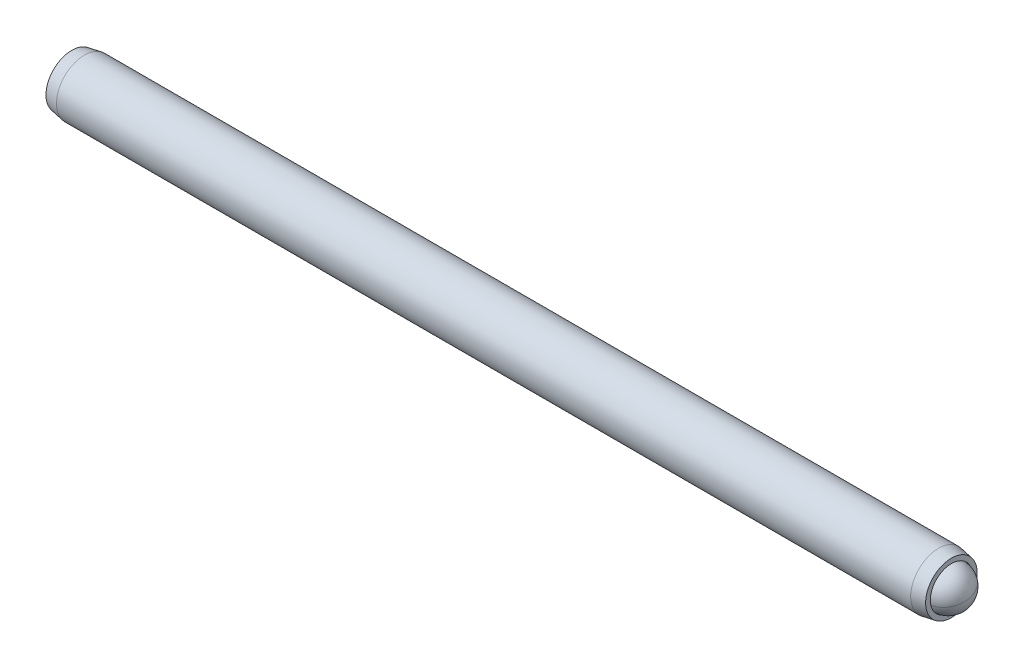
ISO-10303-21;
HEADER;
FILE_DESCRIPTION(('STEP AP214'),'2;1');
FILE_NAME('part.step','',(''),(''),'','','');
FILE_SCHEMA(('AUTOMOTIVE_DESIGN { 1 0 10303 214 1 1 1 1 }'));
ENDSEC;
DATA;
#1=APPLICATION_CONTEXT('core data for automotive mechanical design processes');
#2=APPLICATION_PROTOCOL_DEFINITION('international standard','automotive_design',2000,#1);
#3=PRODUCT_CONTEXT('',#1,'mechanical');
#4=PRODUCT('Part','Part','',(#3));
#5=PRODUCT_RELATED_PRODUCT_CATEGORY('part','',(#4));
#6=PRODUCT_DEFINITION_FORMATION('','',#4);
#7=PRODUCT_DEFINITION_CONTEXT('part definition',#1,'design');
#8=PRODUCT_DEFINITION('design','',#6,#7);
#9=PRODUCT_DEFINITION_SHAPE('','',#8);
#10=(LENGTH_UNIT() NAMED_UNIT(*) SI_UNIT(.MILLI.,.METRE.));
#11=(NAMED_UNIT(*) PLANE_ANGLE_UNIT() SI_UNIT($,.RADIAN.));
#12=(NAMED_UNIT(*) SI_UNIT($,.STERADIAN.) SOLID_ANGLE_UNIT());
#13=UNCERTAINTY_MEASURE_WITH_UNIT(LENGTH_MEASURE(1.E-05),#10,'distance_accuracy_value','');
#14=(GEOMETRIC_REPRESENTATION_CONTEXT(3) GLOBAL_UNCERTAINTY_ASSIGNED_CONTEXT((#13)) GLOBAL_UNIT_ASSIGNED_CONTEXT((#10,
#11,#12)) REPRESENTATION_CONTEXT('',''));
#15=CARTESIAN_POINT('',(0.,0.,0.));
#16=DIRECTION('',(0.,0.,1.));
#17=DIRECTION('',(1.,0.,0.));
#18=AXIS2_PLACEMENT_3D('',#15,#16,#17);
#19=CARTESIAN_POINT('',(-52.5013459470191,2.74204998828508,-0.965131231055238));
#20=DIRECTION('',(-1.,0.,0.));
#21=DIRECTION('',(0.,-1.,0.));
#22=AXIS2_PLACEMENT_3D('',#19,#20,#21);
#23=PLANE('',#22);
#24=DIRECTION('',(0.,0.866025403784439,-0.5));
#25=VECTOR('',#24,1.);
#26=CARTESIAN_POINT('',(-52.5013459470191,2.61504998828507,-2.33078112403967));
#27=LINE('',#26,#25);
#28=CARTESIAN_POINT('',(-52.5013459470191,1.49586248828506,-1.684617919641));
#29=VERTEX_POINT('',#28);
#30=CARTESIAN_POINT('',(-52.5013459470191,2.74204998828508,-2.40410460822675));
#31=VERTEX_POINT('',#30);
#32=EDGE_CURVE('P0_E164',#29,#31,#27,.T.);
#33=ORIENTED_EDGE('',*,*,#32,.T.);
#34=DIRECTION('',(0.,0.866025403784439,0.5));
#35=VECTOR('',#34,1.);
#36=CARTESIAN_POINT('',(-52.5013459470191,3.86123748828509,-1.75794140382808));
#37=LINE('',#36,#35);
#38=CARTESIAN_POINT('',(-52.5013459470191,3.9882374882851,-1.684617919641));
#39=VERTEX_POINT('',#38);
#40=EDGE_CURVE('P0_E166',#31,#39,#37,.T.);
#41=ORIENTED_EDGE('',*,*,#40,.T.);
#42=DIRECTION('',(0.,0.,1.));
#43=VECTOR('',#42,1.);
#44=CARTESIAN_POINT('',(-52.5013459470191,3.9882374882851,-0.392291510843656));
#45=LINE('',#44,#43);
#46=CARTESIAN_POINT('',(-52.5013459470191,3.9882374882851,-0.245644542469482));
#47=VERTEX_POINT('',#46);
#48=EDGE_CURVE('P0_E156',#39,#47,#45,.T.);
#49=ORIENTED_EDGE('',*,*,#48,.T.);
#50=DIRECTION('',(0.,-0.866025403784438,0.500000000000001));
#51=VECTOR('',#50,1.);
#52=CARTESIAN_POINT('',(-52.5013459470191,2.86904998828509,0.400518661929189));
#53=LINE('',#52,#51);
#54=CARTESIAN_POINT('',(-52.5013459470191,2.74204998828508,0.473842146116277));
#55=VERTEX_POINT('',#54);
#56=EDGE_CURVE('P0_E158',#47,#55,#53,.T.);
#57=ORIENTED_EDGE('',*,*,#56,.T.);
#58=DIRECTION('',(0.,-0.866025403784439,-0.5));
#59=VECTOR('',#58,1.);
#60=CARTESIAN_POINT('',(-52.5013459470191,1.62286248828507,-0.172321058282393));
#61=LINE('',#60,#59);
#62=CARTESIAN_POINT('',(-52.5013459470191,1.49586248828506,-0.245644542469481));
#63=VERTEX_POINT('',#62);
#64=EDGE_CURVE('P0_E160',#55,#63,#61,.T.);
#65=ORIENTED_EDGE('',*,*,#64,.T.);
#66=DIRECTION('',(0.,0.,-1.));
#67=VECTOR('',#66,1.);
#68=CARTESIAN_POINT('',(-52.5013459470191,1.49586248828506,-1.53797095126682));
#69=LINE('',#68,#67);
#70=EDGE_CURVE('P0_E162',#63,#29,#69,.T.);
#71=ORIENTED_EDGE('',*,*,#70,.T.);
#72=EDGE_LOOP('',(#33,#41,#49,#57,#65,#71));
#73=FACE_BOUND('',#72,.T.);
#74=CARTESIAN_POINT('',(-52.5013459470191,2.74204998828508,-0.965131231055238));
#75=DIRECTION('',(1.,0.,0.));
#76=DIRECTION('',(0.,1.,0.));
#77=AXIS2_PLACEMENT_3D('',#74,#75,#76);
#78=CIRCLE('',#77,2.921);
#79=CARTESIAN_POINT('',(-52.5013459470191,5.66304998828508,-0.965131231055238));
#80=VERTEX_POINT('',#79);
#81=EDGE_CURVE('P0_E150',#80,#80,#78,.T.);
#82=ORIENTED_EDGE('',*,*,#81,.F.);
#83=EDGE_LOOP('',(#82));
#84=FACE_BOUND('',#83,.T.);
#85=ADVANCED_FACE('P0_F17',(#73,#84),#23,.T.);
#86=CARTESIAN_POINT('',(-51.0608403648362,2.74204998828508,-0.965131231055238));
#87=DIRECTION('',(1.,0.,0.));
#88=DIRECTION('',(0.,1.,0.));
#89=AXIS2_PLACEMENT_3D('',#86,#87,#88);
#90=CONICAL_SURFACE('',#89,3.175,0.174532925199433);
#91=ORIENTED_EDGE('',*,*,#81,.T.);
#92=EDGE_LOOP('',(#91));
#93=FACE_BOUND('',#92,.T.);
#94=CARTESIAN_POINT('',(-51.0608403648362,2.74204998828508,-0.965131231055238));
#95=DIRECTION('',(1.,0.,0.));
#96=DIRECTION('',(0.,1.,0.));
#97=AXIS2_PLACEMENT_3D('',#94,#95,#96);
#98=CIRCLE('',#97,3.175);
#99=CARTESIAN_POINT('',(-51.0608403648362,5.91704998828508,-0.965131231055238));
#100=VERTEX_POINT('',#99);
#101=EDGE_CURVE('P0_E147',#100,#100,#98,.T.);
#102=ORIENTED_EDGE('',*,*,#101,.F.);
#103=EDGE_LOOP('',(#102));
#104=FACE_BOUND('',#103,.T.);
#105=ADVANCED_FACE('P0_F225',(#93,#104),#90,.T.);
#106=CARTESIAN_POINT('',(43.34980800758,2.7420499882851,-0.965131231055238));
#107=DIRECTION('',(1.,0.,0.));
#108=DIRECTION('',(0.,1.,0.));
#109=AXIS2_PLACEMENT_3D('',#106,#107,#108);
#110=CYLINDRICAL_SURFACE('',#109,3.17499999999999);
#111=ORIENTED_EDGE('',*,*,#101,.T.);
#112=EDGE_LOOP('',(#111));
#113=FACE_BOUND('',#112,.T.);
#114=CARTESIAN_POINT('',(45.626148470798,2.7420499882851,-0.965131231055238));
#115=DIRECTION('',(1.,0.,0.));
#116=DIRECTION('',(0.,1.,0.));
#117=AXIS2_PLACEMENT_3D('',#114,#115,#116);
#118=CIRCLE('',#117,3.17499999999999);
#119=CARTESIAN_POINT('',(45.626148470798,5.91704998828508,-0.965131231055238));
#120=VERTEX_POINT('',#119);
#121=EDGE_CURVE('P0_E144',#120,#120,#118,.T.);
#122=ORIENTED_EDGE('',*,*,#121,.F.);
#123=EDGE_LOOP('',(#122));
#124=FACE_BOUND('',#123,.T.);
#125=ADVANCED_FACE('P0_F231',(#113,#124),#110,.T.);
#126=CARTESIAN_POINT('',(47.0666540529809,2.7420499882851,-0.965131231055238));
#127=DIRECTION('',(-1.,0.,0.));
#128=DIRECTION('',(0.,-1.,0.));
#129=AXIS2_PLACEMENT_3D('',#126,#127,#128);
#130=CONICAL_SURFACE('',#129,2.92099999999999,0.174532925199434);
#131=ORIENTED_EDGE('',*,*,#121,.T.);
#132=EDGE_LOOP('',(#131));
#133=FACE_BOUND('',#132,.T.);
#134=CARTESIAN_POINT('',(47.0666540529809,2.7420499882851,-0.965131231055238));
#135=DIRECTION('',(1.,0.,0.));
#136=DIRECTION('',(0.,1.,0.));
#137=AXIS2_PLACEMENT_3D('',#134,#135,#136);
#138=CIRCLE('',#137,2.92099999999999);
#139=CARTESIAN_POINT('',(47.0666540529809,5.66304998828508,-0.965131231055238));
#140=VERTEX_POINT('',#139);
#141=EDGE_CURVE('P0_E141',#140,#140,#138,.T.);
#142=ORIENTED_EDGE('',*,*,#141,.F.);
#143=EDGE_LOOP('',(#142));
#144=FACE_BOUND('',#143,.T.);
#145=ADVANCED_FACE('P0_F275',(#133,#144),#130,.T.);
#146=CARTESIAN_POINT('',(47.0666540529809,5.66304998828508,-0.965131231055238));
#147=DIRECTION('',(1.,0.,0.));
#148=DIRECTION('',(0.,1.,0.));
#149=AXIS2_PLACEMENT_3D('',#146,#147,#148);
#150=PLANE('',#149);
#151=ORIENTED_EDGE('',*,*,#141,.T.);
#152=EDGE_LOOP('',(#151));
#153=FACE_BOUND('',#152,.T.);
#154=CARTESIAN_POINT('',(47.0666540529809,2.7420499882851,-0.965131231055238));
#155=DIRECTION('',(1.,0.,0.));
#156=DIRECTION('',(0.,1.,0.));
#157=AXIS2_PLACEMENT_3D('',#154,#155,#156);
#158=CIRCLE('',#157,2.38760000000001);
#159=CARTESIAN_POINT('',(47.0666540529809,5.1296499882851,-0.965131231055238));
#160=VERTEX_POINT('',#159);
#161=EDGE_CURVE('P0_E138',#160,#160,#158,.T.);
#162=ORIENTED_EDGE('',*,*,#161,.F.);
#163=EDGE_LOOP('',(#162));
#164=FACE_BOUND('',#163,.T.);
#165=ADVANCED_FACE('P0_F271',(#153,#164),#150,.T.);
#166=CARTESIAN_POINT('',(43.34980800758,2.7420499882851,-0.965131231055238));
#167=DIRECTION('',(1.,0.,0.));
#168=DIRECTION('',(0.,1.,0.));
#169=AXIS2_PLACEMENT_3D('',#166,#167,#168);
#170=CYLINDRICAL_SURFACE('',#169,2.38760000000001);
#171=ORIENTED_EDGE('',*,*,#161,.T.);
#172=EDGE_LOOP('',(#171));
#173=FACE_BOUND('',#172,.T.);
#174=CARTESIAN_POINT('',(45.73740800758,2.7420499882851,-0.965131231055238));
#175=DIRECTION('',(1.,0.,0.));
#176=DIRECTION('',(0.,1.,0.));
#177=AXIS2_PLACEMENT_3D('',#174,#175,#176);
#178=CIRCLE('',#177,2.38760000000001);
#179=CARTESIAN_POINT('',(45.73740800758,5.1296499882851,-0.965131231055238));
#180=VERTEX_POINT('',#179);
#181=EDGE_CURVE('P0_E126',#180,#180,#178,.T.);
#182=ORIENTED_EDGE('',*,*,#181,.F.);
#183=EDGE_LOOP('',(#182));
#184=FACE_BOUND('',#183,.T.);
#185=ADVANCED_FACE('P0_F267',(#173,#184),#170,.F.);
#186=CARTESIAN_POINT('',(43.34980800758,2.7420499882851,-0.965131231055238));
#187=DIRECTION('',(1.,0.,0.));
#188=DIRECTION('',(0.,1.,0.));
#189=AXIS2_PLACEMENT_3D('',#186,#187,#188);
#190=CONICAL_SURFACE('',#189,0.,0.78539816339745);
#191=ORIENTED_EDGE('',*,*,#181,.T.);
#192=EDGE_LOOP('',(#191));
#193=FACE_BOUND('',#192,.T.);
#194=CARTESIAN_POINT('',(43.34980800758,2.7420499882851,-0.965131231055238));
#195=VERTEX_POINT('',#194);
#196=VERTEX_LOOP('',#195);
#197=FACE_BOUND('',#196,.T.);
#198=ADVANCED_FACE('P0_F221',(#193,#197),#190,.F.);
#199=CARTESIAN_POINT('',(-49.4533459470191,2.74204998828508,0.180548209367926));
#200=DIRECTION('',(0.,0.5,0.866025403784438));
#201=DIRECTION('',(0.,-0.866025403784438,0.500000000000001));
#202=AXIS2_PLACEMENT_3D('',#199,#200,#201);
#203=PLANE('',#202);
#204=DIRECTION('',(-1.,0.,0.));
#205=VECTOR('',#204,1.);
#206=CARTESIAN_POINT('',(-49.4533459470191,2.74204998828508,0.180548209367926));
#207=LINE('',#206,#205);
#208=CARTESIAN_POINT('',(-49.4533459470191,2.74204998828508,0.180548209367926));
#209=VERTEX_POINT('',#208);
#210=CARTESIAN_POINT('',(-52.2473459470191,2.74204998828508,0.180548209367926));
#211=VERTEX_POINT('',#210);
#212=EDGE_CURVE('P0_E124',#209,#211,#207,.T.);
#213=ORIENTED_EDGE('',*,*,#212,.T.);
#214=DIRECTION('',(0.,0.866025403784438,-0.500000000000001));
#215=VECTOR('',#214,1.);
#216=CARTESIAN_POINT('',(-52.2473459470191,3.73423748828508,-0.392291510843656));
#217=LINE('',#216,#215);
#218=CARTESIAN_POINT('',(-52.2473459470191,3.73423748828508,-0.392291510843656));
#219=VERTEX_POINT('',#218);
#220=EDGE_CURVE('P0_E26',#211,#219,#217,.T.);
#221=ORIENTED_EDGE('',*,*,#220,.T.);
#222=DIRECTION('',(-1.,0.,0.));
#223=VECTOR('',#222,1.);
#224=CARTESIAN_POINT('',(-49.4533459470191,3.73423748828508,-0.392291510843656));
#225=LINE('',#224,#223);
#226=CARTESIAN_POINT('',(-49.4533459470191,3.73423748828508,-0.392291510843656));
#227=VERTEX_POINT('',#226);
#228=EDGE_CURVE('P0_E90',#227,#219,#225,.T.);
#229=ORIENTED_EDGE('',*,*,#228,.F.);
#230=DIRECTION('',(0.,0.866025403784438,-0.5));
#231=VECTOR('',#230,1.);
#232=CARTESIAN_POINT('',(-49.4533459470191,2.74204998828508,0.180548209367926));
#233=LINE('',#232,#231);
#234=EDGE_CURVE('P0_E94',#209,#227,#233,.T.);
#235=ORIENTED_EDGE('',*,*,#234,.F.);
#236=EDGE_LOOP('',(#213,#221,#229,#235));
#237=FACE_BOUND('',#236,.T.);
#238=ADVANCED_FACE('P0_F92',(#237),#203,.F.);
#239=CARTESIAN_POINT('',(-49.4533459470191,1.74986248828508,-0.392291510843656));
#240=DIRECTION('',(0.,-0.499999999999999,0.866025403784439));
#241=DIRECTION('',(0.,-0.866025403784439,-0.5));
#242=AXIS2_PLACEMENT_3D('',#239,#240,#241);
#243=PLANE('',#242);
#244=DIRECTION('',(-1.,0.,0.));
#245=VECTOR('',#244,1.);
#246=CARTESIAN_POINT('',(-49.4533459470191,1.74986248828508,-0.392291510843656));
#247=LINE('',#246,#245);
#248=CARTESIAN_POINT('',(-49.4533459470191,1.74986248828508,-0.392291510843656));
#249=VERTEX_POINT('',#248);
#250=CARTESIAN_POINT('',(-52.2473459470191,1.74986248828508,-0.392291510843656));
#251=VERTEX_POINT('',#250);
#252=EDGE_CURVE('P0_E127',#249,#251,#247,.T.);
#253=ORIENTED_EDGE('',*,*,#252,.T.);
#254=DIRECTION('',(0.,0.866025403784439,0.5));
#255=VECTOR('',#254,1.);
#256=CARTESIAN_POINT('',(-52.2473459470191,2.74204998828508,0.180548209367926));
#257=LINE('',#256,#255);
#258=EDGE_CURVE('P0_E41',#251,#211,#257,.T.);
#259=ORIENTED_EDGE('',*,*,#258,.T.);
#260=ORIENTED_EDGE('',*,*,#212,.F.);
#261=DIRECTION('',(0.,0.866025403784439,0.499999999999999));
#262=VECTOR('',#261,1.);
#263=CARTESIAN_POINT('',(-49.4533459470191,1.74986248828508,-0.392291510843656));
#264=LINE('',#263,#262);
#265=EDGE_CURVE('P0_E99',#249,#209,#264,.T.);
#266=ORIENTED_EDGE('',*,*,#265,.F.);
#267=EDGE_LOOP('',(#253,#259,#260,#266));
#268=FACE_BOUND('',#267,.T.);
#269=ADVANCED_FACE('P0_F212',(#268),#243,.F.);
#270=CARTESIAN_POINT('',(-49.4533459470191,1.74986248828508,-1.53797095126682));
#271=DIRECTION('',(0.,-1.,0.));
#272=DIRECTION('',(0.,0.,-1.));
#273=AXIS2_PLACEMENT_3D('',#270,#271,#272);
#274=PLANE('',#273);
#275=DIRECTION('',(-1.,0.,0.));
#276=VECTOR('',#275,1.);
#277=CARTESIAN_POINT('',(-49.4533459470191,1.74986248828508,-1.53797095126682));
#278=LINE('',#277,#276);
#279=CARTESIAN_POINT('',(-49.4533459470191,1.74986248828508,-1.53797095126682));
#280=VERTEX_POINT('',#279);
#281=CARTESIAN_POINT('',(-52.2473459470191,1.74986248828508,-1.53797095126682));
#282=VERTEX_POINT('',#281);
#283=EDGE_CURVE('P0_E129',#280,#282,#278,.T.);
#284=ORIENTED_EDGE('',*,*,#283,.T.);
#285=DIRECTION('',(0.,0.,1.));
#286=VECTOR('',#285,1.);
#287=CARTESIAN_POINT('',(-52.2473459470191,1.74986248828508,-0.392291510843656));
#288=LINE('',#287,#286);
#289=EDGE_CURVE('P0_E171',#282,#251,#288,.T.);
#290=ORIENTED_EDGE('',*,*,#289,.T.);
#291=ORIENTED_EDGE('',*,*,#252,.F.);
#292=DIRECTION('',(0.,0.,1.));
#293=VECTOR('',#292,1.);
#294=CARTESIAN_POINT('',(-49.4533459470191,1.74986248828508,-1.53797095126682));
#295=LINE('',#294,#293);
#296=EDGE_CURVE('P0_E121',#280,#249,#295,.T.);
#297=ORIENTED_EDGE('',*,*,#296,.F.);
#298=EDGE_LOOP('',(#284,#290,#291,#297));
#299=FACE_BOUND('',#298,.T.);
#300=ADVANCED_FACE('P0_F211',(#299),#274,.F.);
#301=CARTESIAN_POINT('',(-49.4533459470191,2.74204998828508,-2.1108106714784));
#302=DIRECTION('',(0.,-0.5,-0.866025403784439));
#303=DIRECTION('',(0.,0.866025403784439,-0.5));
#304=AXIS2_PLACEMENT_3D('',#301,#302,#303);
#305=PLANE('',#304);
#306=DIRECTION('',(-1.,0.,0.));
#307=VECTOR('',#306,1.);
#308=CARTESIAN_POINT('',(-49.4533459470191,2.74204998828508,-2.1108106714784));
#309=LINE('',#308,#307);
#310=CARTESIAN_POINT('',(-49.4533459470191,2.74204998828508,-2.1108106714784));
#311=VERTEX_POINT('',#310);
#312=CARTESIAN_POINT('',(-52.2473459470191,2.74204998828508,-2.1108106714784));
#313=VERTEX_POINT('',#312);
#314=EDGE_CURVE('P0_E132',#311,#313,#309,.T.);
#315=ORIENTED_EDGE('',*,*,#314,.T.);
#316=DIRECTION('',(0.,-0.866025403784439,0.5));
#317=VECTOR('',#316,1.);
#318=CARTESIAN_POINT('',(-52.2473459470191,1.74986248828508,-1.53797095126682));
#319=LINE('',#318,#317);
#320=EDGE_CURVE('P0_E169',#313,#282,#319,.T.);
#321=ORIENTED_EDGE('',*,*,#320,.T.);
#322=ORIENTED_EDGE('',*,*,#283,.F.);
#323=DIRECTION('',(0.,-0.866025403784439,0.5));
#324=VECTOR('',#323,1.);
#325=CARTESIAN_POINT('',(-49.4533459470191,2.74204998828508,-2.1108106714784));
#326=LINE('',#325,#324);
#327=EDGE_CURVE('P0_E118',#311,#280,#326,.T.);
#328=ORIENTED_EDGE('',*,*,#327,.F.);
#329=EDGE_LOOP('',(#315,#321,#322,#328));
#330=FACE_BOUND('',#329,.T.);
#331=ADVANCED_FACE('P0_F208',(#330),#305,.F.);
#332=CARTESIAN_POINT('',(-49.4533459470191,3.73423748828508,-1.53797095126682));
#333=DIRECTION('',(0.,0.5,-0.866025403784439));
#334=DIRECTION('',(0.,0.866025403784439,0.5));
#335=AXIS2_PLACEMENT_3D('',#332,#333,#334);
#336=PLANE('',#335);
#337=DIRECTION('',(-1.,0.,0.));
#338=VECTOR('',#337,1.);
#339=CARTESIAN_POINT('',(-49.4533459470191,3.73423748828508,-1.53797095126682));
#340=LINE('',#339,#338);
#341=CARTESIAN_POINT('',(-49.4533459470191,3.73423748828508,-1.53797095126682));
#342=VERTEX_POINT('',#341);
#343=CARTESIAN_POINT('',(-52.2473459470191,3.73423748828508,-1.53797095126682));
#344=VERTEX_POINT('',#343);
#345=EDGE_CURVE('P0_E98',#342,#344,#340,.T.);
#346=ORIENTED_EDGE('',*,*,#345,.T.);
#347=DIRECTION('',(0.,-0.866025403784439,-0.5));
#348=VECTOR('',#347,1.);
#349=CARTESIAN_POINT('',(-52.2473459470191,2.74204998828508,-2.1108106714784));
#350=LINE('',#349,#348);
#351=EDGE_CURVE('P0_E153',#344,#313,#350,.T.);
#352=ORIENTED_EDGE('',*,*,#351,.T.);
#353=ORIENTED_EDGE('',*,*,#314,.F.);
#354=DIRECTION('',(0.,-0.866025403784439,-0.5));
#355=VECTOR('',#354,1.);
#356=CARTESIAN_POINT('',(-49.4533459470191,3.73423748828508,-1.53797095126682));
#357=LINE('',#356,#355);
#358=EDGE_CURVE('P0_E108',#342,#311,#357,.T.);
#359=ORIENTED_EDGE('',*,*,#358,.F.);
#360=EDGE_LOOP('',(#346,#352,#353,#359));
#361=FACE_BOUND('',#360,.T.);
#362=ADVANCED_FACE('P0_F204',(#361),#336,.F.);
#363=CARTESIAN_POINT('',(-49.4533459470191,3.73423748828508,-0.392291510843656));
#364=DIRECTION('',(0.,1.,0.));
#365=DIRECTION('',(-1.,0.,0.));
#366=AXIS2_PLACEMENT_3D('',#363,#364,#365);
#367=PLANE('',#366);
#368=ORIENTED_EDGE('',*,*,#228,.T.);
#369=DIRECTION('',(0.,0.,-1.));
#370=VECTOR('',#369,1.);
#371=CARTESIAN_POINT('',(-52.2473459470191,3.73423748828508,-1.53797095126682));
#372=LINE('',#371,#370);
#373=EDGE_CURVE('P0_E11',#219,#344,#372,.T.);
#374=ORIENTED_EDGE('',*,*,#373,.T.);
#375=ORIENTED_EDGE('',*,*,#345,.F.);
#376=DIRECTION('',(0.,0.,-1.));
#377=VECTOR('',#376,1.);
#378=CARTESIAN_POINT('',(-49.4533459470191,3.73423748828508,-0.392291510843656));
#379=LINE('',#378,#377);
#380=EDGE_CURVE('P0_E102',#227,#342,#379,.T.);
#381=ORIENTED_EDGE('',*,*,#380,.F.);
#382=EDGE_LOOP('',(#368,#374,#375,#381));
#383=FACE_BOUND('',#382,.T.);
#384=ADVANCED_FACE('P0_F103',(#383),#367,.F.);
#385=CARTESIAN_POINT('',(-49.4533459470191,4.72642498828508,-0.965131231055239));
#386=DIRECTION('',(-1.,0.,0.));
#387=DIRECTION('',(0.,0.,1.));
#388=AXIS2_PLACEMENT_3D('',#385,#386,#387);
#389=PLANE('',#388);
#390=ORIENTED_EDGE('',*,*,#234,.T.);
#391=ORIENTED_EDGE('',*,*,#380,.T.);
#392=ORIENTED_EDGE('',*,*,#358,.T.);
#393=ORIENTED_EDGE('',*,*,#327,.T.);
#394=ORIENTED_EDGE('',*,*,#296,.T.);
#395=ORIENTED_EDGE('',*,*,#265,.T.);
#396=EDGE_LOOP('',(#390,#391,#392,#393,#394,#395));
#397=FACE_BOUND('',#396,.T.);
#398=ADVANCED_FACE('P0_F110',(#397),#389,.T.);
#399=CARTESIAN_POINT('',(-52.2473459470191,1.74986248828508,-0.392291510843656));
#400=DIRECTION('',(-0.707106781186567,0.353553390593264,-0.612372435695778));
#401=DIRECTION('',(-0.654653670707957,0.,0.755928946018472));
#402=AXIS2_PLACEMENT_3D('',#399,#400,#401);
#403=PLANE('',#402);
#404=DIRECTION('',(-0.654653670707957,-0.654653670707993,0.377964473009236));
#405=VECTOR('',#404,1.);
#406=CARTESIAN_POINT('',(-51.963863804162,2.03334463114223,-0.555960002332687));
#407=LINE('',#406,#405);
#408=EDGE_CURVE('P0_E115',#63,#251,#407,.F.);
#409=ORIENTED_EDGE('',*,*,#408,.F.);
#410=ORIENTED_EDGE('',*,*,#64,.F.);
#411=DIRECTION('',(-0.654653670707957,0.,0.755928946018472));
#412=VECTOR('',#411,1.);
#413=CARTESIAN_POINT('',(-51.963863804162,2.74204998828508,-0.146788773610136));
#414=LINE('',#413,#412);
#415=EDGE_CURVE('P0_E21',#211,#55,#414,.T.);
#416=ORIENTED_EDGE('',*,*,#415,.F.);
#417=ORIENTED_EDGE('',*,*,#258,.F.);
#418=EDGE_LOOP('',(#409,#410,#416,#417));
#419=FACE_BOUND('',#418,.T.);
#420=ADVANCED_FACE('P0_F19',(#419),#403,.T.);
#421=CARTESIAN_POINT('',(-52.2473459470191,2.74204998828508,0.180548209367926));
#422=DIRECTION('',(-0.707106781186567,-0.353553390593265,-0.612372435695778));
#423=DIRECTION('',(-0.654653670707957,0.,0.755928946018472));
#424=AXIS2_PLACEMENT_3D('',#421,#422,#423);
#425=PLANE('',#424);
#426=ORIENTED_EDGE('',*,*,#415,.T.);
#427=ORIENTED_EDGE('',*,*,#56,.F.);
#428=DIRECTION('',(-0.654653670707957,0.654653670707993,0.377964473009236));
#429=VECTOR('',#428,1.);
#430=CARTESIAN_POINT('',(-51.963863804162,3.45075534542792,-0.555960002332687));
#431=LINE('',#430,#429);
#432=EDGE_CURVE('P0_E182',#219,#47,#431,.T.);
#433=ORIENTED_EDGE('',*,*,#432,.F.);
#434=ORIENTED_EDGE('',*,*,#220,.F.);
#435=EDGE_LOOP('',(#426,#427,#433,#434));
#436=FACE_BOUND('',#435,.T.);
#437=ADVANCED_FACE('P0_F196',(#436),#425,.T.);
#438=CARTESIAN_POINT('',(-52.2473459470191,1.74986248828508,-1.53797095126682));
#439=DIRECTION('',(-0.707106781186567,0.707106781186528,0.));
#440=DIRECTION('',(-0.707106781186528,-0.707106781186567,0.));
#441=AXIS2_PLACEMENT_3D('',#438,#439,#440);
#442=PLANE('',#441);
#443=ORIENTED_EDGE('',*,*,#408,.T.);
#444=ORIENTED_EDGE('',*,*,#289,.F.);
#445=DIRECTION('',(-0.654653670707956,-0.654653670707993,-0.377964473009237));
#446=VECTOR('',#445,1.);
#447=CARTESIAN_POINT('',(-51.963863804162,2.03334463114223,-1.37430245977779));
#448=LINE('',#447,#446);
#449=EDGE_CURVE('P0_E179',#29,#282,#448,.F.);
#450=ORIENTED_EDGE('',*,*,#449,.F.);
#451=ORIENTED_EDGE('',*,*,#70,.F.);
#452=EDGE_LOOP('',(#443,#444,#450,#451));
#453=FACE_BOUND('',#452,.T.);
#454=ADVANCED_FACE('P0_F189',(#453),#442,.T.);
#455=CARTESIAN_POINT('',(-52.2473459470191,3.73423748828508,-0.392291510843656));
#456=DIRECTION('',(-0.707106781186567,-0.707106781186528,0.));
#457=DIRECTION('',(0.707106781186528,-0.707106781186567,0.));
#458=AXIS2_PLACEMENT_3D('',#455,#456,#457);
#459=PLANE('',#458);
#460=ORIENTED_EDGE('',*,*,#432,.T.);
#461=ORIENTED_EDGE('',*,*,#48,.F.);
#462=DIRECTION('',(0.654653670707956,-0.654653670707992,0.377964473009237));
#463=VECTOR('',#462,1.);
#464=CARTESIAN_POINT('',(-52.2473459470191,3.73423748828508,-1.53797095126682));
#465=LINE('',#464,#463);
#466=EDGE_CURVE('P0_E177',#344,#39,#465,.F.);
#467=ORIENTED_EDGE('',*,*,#466,.F.);
#468=ORIENTED_EDGE('',*,*,#373,.F.);
#469=EDGE_LOOP('',(#460,#461,#467,#468));
#470=FACE_BOUND('',#469,.T.);
#471=ADVANCED_FACE('P0_F201',(#470),#459,.T.);
#472=CARTESIAN_POINT('',(-52.2473459470191,2.74204998828508,-2.1108106714784));
#473=DIRECTION('',(-0.707106781186567,0.353553390593264,0.612372435695777));
#474=DIRECTION('',(0.654653670707956,0.,0.755928946018473));
#475=AXIS2_PLACEMENT_3D('',#472,#473,#474);
#476=PLANE('',#475);
#477=ORIENTED_EDGE('',*,*,#449,.T.);
#478=ORIENTED_EDGE('',*,*,#320,.F.);
#479=DIRECTION('',(-0.654653670707956,0.,-0.755928946018472));
#480=VECTOR('',#479,1.);
#481=CARTESIAN_POINT('',(-51.963863804162,2.74204998828508,-1.78347368850034));
#482=LINE('',#481,#480);
#483=EDGE_CURVE('P0_E175',#31,#313,#482,.F.);
#484=ORIENTED_EDGE('',*,*,#483,.F.);
#485=ORIENTED_EDGE('',*,*,#32,.F.);
#486=EDGE_LOOP('',(#477,#478,#484,#485));
#487=FACE_BOUND('',#486,.T.);
#488=ADVANCED_FACE('P0_F240',(#487),#476,.T.);
#489=CARTESIAN_POINT('',(-52.2473459470191,3.73423748828508,-1.53797095126682));
#490=DIRECTION('',(-0.707106781186567,-0.353553390593264,0.612372435695778));
#491=DIRECTION('',(0.654653670707956,0.,0.755928946018472));
#492=AXIS2_PLACEMENT_3D('',#489,#490,#491);
#493=PLANE('',#492);
#494=ORIENTED_EDGE('',*,*,#466,.T.);
#495=ORIENTED_EDGE('',*,*,#40,.F.);
#496=ORIENTED_EDGE('',*,*,#483,.T.);
#497=ORIENTED_EDGE('',*,*,#351,.F.);
#498=EDGE_LOOP('',(#494,#495,#496,#497));
#499=FACE_BOUND('',#498,.T.);
#500=ADVANCED_FACE('P0_F237',(#499),#493,.T.);
#501=CLOSED_SHELL('',(#85,#105,#125,#145,#165,#185,#198,#238,#269,#300,#331,#362,#384,#398,#420,
#437,#454,#471,#488,#500));
#502=MANIFOLD_SOLID_BREP('P0_B1',#501);
#503=CARTESIAN_POINT('',(46.7174040529809,2.7420499882851,-0.965131231055239));
#504=DIRECTION('',(0.,0.972214232741158,0.234092899626454));
#505=DIRECTION('',(0.,0.234092899626454,-0.972214232741158));
#506=AXIS2_PLACEMENT_3D('',#503,#504,#505);
#507=SPHERICAL_SURFACE('',#506,2.38125);
#508=CARTESIAN_POINT('',(46.7174040529809,2.7420499882851,-0.965131231055239));
#509=DIRECTION('',(1.,0.,0.));
#510=DIRECTION('',(0.,0.234092899626454,-0.972214232741158));
#511=AXIS2_PLACEMENT_3D('',#508,#509,#510);
#512=CIRCLE('',#511,2.38125);
#513=CARTESIAN_POINT('',(46.7174040529809,3.29948370552059,-3.28021637277012));
#514=VERTEX_POINT('',#513);
#515=CARTESIAN_POINT('',(46.7174040529809,2.1846162710496,1.34995391065964));
#516=VERTEX_POINT('',#515);
#517=EDGE_CURVE('P1_E33',#514,#516,#512,.T.);
#518=ORIENTED_EDGE('',*,*,#517,.T.);
#519=CARTESIAN_POINT('',(46.7174040529809,2.7420499882851,-0.965131231055239));
#520=DIRECTION('',(0.,0.972214232741158,0.234092899626454));
#521=DIRECTION('',(1.,0.,0.));
#522=AXIS2_PLACEMENT_3D('',#519,#520,#521);
#523=CIRCLE('',#522,2.38125);
#524=EDGE_CURVE('P1_E10',#516,#514,#523,.T.);
#525=ORIENTED_EDGE('',*,*,#524,.T.);
#526=EDGE_LOOP('',(#518,#525));
#527=FACE_BOUND('',#526,.T.);
#528=ADVANCED_FACE('P1_F16',(#527),#507,.T.);
#529=ORIENTED_EDGE('',*,*,#517,.F.);
#530=CARTESIAN_POINT('',(46.7174040529809,2.7420499882851,-0.965131231055239));
#531=DIRECTION('',(0.,0.972214232741158,0.234092899626454));
#532=DIRECTION('',(1.,0.,0.));
#533=AXIS2_PLACEMENT_3D('',#530,#531,#532);
#534=CIRCLE('',#533,2.38125);
#535=EDGE_CURVE('P1_E23',#514,#516,#534,.T.);
#536=ORIENTED_EDGE('',*,*,#535,.T.);
#537=EDGE_LOOP('',(#529,#536));
#538=FACE_BOUND('',#537,.T.);
#539=ADVANCED_FACE('P1_F40',(#538),#507,.T.);
#540=ORIENTED_EDGE('',*,*,#524,.F.);
#541=EDGE_CURVE('P1_E36',#516,#514,#512,.T.);
#542=ORIENTED_EDGE('',*,*,#541,.T.);
#543=EDGE_LOOP('',(#540,#542));
#544=FACE_BOUND('',#543,.T.);
#545=ADVANCED_FACE('P1_F38',(#544),#507,.T.);
#546=ORIENTED_EDGE('',*,*,#535,.F.);
#547=ORIENTED_EDGE('',*,*,#541,.F.);
#548=EDGE_LOOP('',(#546,#547));
#549=FACE_BOUND('',#548,.T.);
#550=ADVANCED_FACE('P1_F18',(#549),#507,.T.);
#551=CLOSED_SHELL('',(#528,#539,#545,#550));
#552=MANIFOLD_SOLID_BREP('P1_B1',#551);
#553=ADVANCED_BREP_SHAPE_REPRESENTATION('',(#18,#502,#552),#14);
#554=SHAPE_DEFINITION_REPRESENTATION(#9,#553);
ENDSEC;
END-ISO-10303-21;
